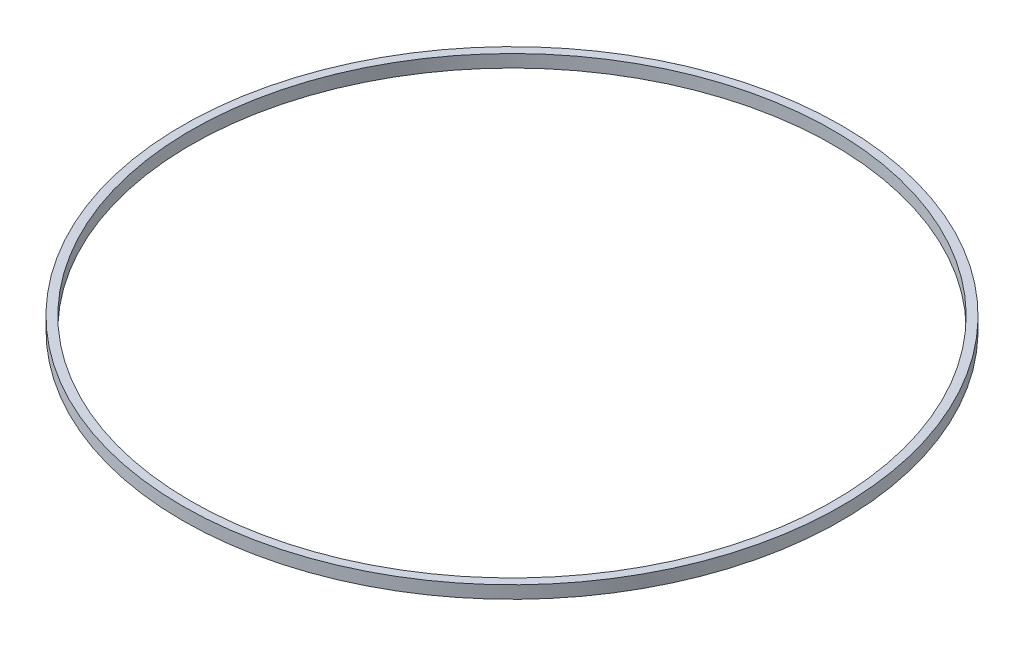
ISO-10303-21;
HEADER;
FILE_DESCRIPTION(('STEP AP214'),'2;1');
FILE_NAME('part.step','',(''),(''),'','','');
FILE_SCHEMA(('AUTOMOTIVE_DESIGN { 1 0 10303 214 1 1 1 1 }'));
ENDSEC;
DATA;
#1=APPLICATION_CONTEXT('core data for automotive mechanical design processes');
#2=APPLICATION_PROTOCOL_DEFINITION('international standard','automotive_design',2000,#1);
#3=PRODUCT_CONTEXT('',#1,'mechanical');
#4=PRODUCT('Part','Part','',(#3));
#5=PRODUCT_RELATED_PRODUCT_CATEGORY('part','',(#4));
#6=PRODUCT_DEFINITION_FORMATION('','',#4);
#7=PRODUCT_DEFINITION_CONTEXT('part definition',#1,'design');
#8=PRODUCT_DEFINITION('design','',#6,#7);
#9=PRODUCT_DEFINITION_SHAPE('','',#8);
#10=(LENGTH_UNIT() NAMED_UNIT(*) SI_UNIT(.MILLI.,.METRE.));
#11=(NAMED_UNIT(*) PLANE_ANGLE_UNIT() SI_UNIT($,.RADIAN.));
#12=(NAMED_UNIT(*) SI_UNIT($,.STERADIAN.) SOLID_ANGLE_UNIT());
#13=UNCERTAINTY_MEASURE_WITH_UNIT(LENGTH_MEASURE(1.E-05),#10,'distance_accuracy_value','');
#14=(GEOMETRIC_REPRESENTATION_CONTEXT(3) GLOBAL_UNCERTAINTY_ASSIGNED_CONTEXT((#13)) GLOBAL_UNIT_ASSIGNED_CONTEXT((#10,
#11,#12)) REPRESENTATION_CONTEXT('',''));
#15=CARTESIAN_POINT('',(0.,0.,0.));
#16=DIRECTION('',(0.,0.,1.));
#17=DIRECTION('',(1.,0.,0.));
#18=AXIS2_PLACEMENT_3D('',#15,#16,#17);
#19=CARTESIAN_POINT('',(0.,3.,0.));
#20=DIRECTION('',(0.,-1.,0.));
#21=DIRECTION('',(0.,0.,-1.));
#22=AXIS2_PLACEMENT_3D('',#19,#20,#21);
#23=CYLINDRICAL_SURFACE('',#22,78.5);
#24=CARTESIAN_POINT('',(0.,3.,0.));
#25=DIRECTION('',(0.,1.,0.));
#26=DIRECTION('',(0.,0.,1.));
#27=AXIS2_PLACEMENT_3D('',#24,#25,#26);
#28=CIRCLE('',#27,78.5);
#29=CARTESIAN_POINT('',(0.,3.,78.5));
#30=VERTEX_POINT('',#29);
#31=EDGE_CURVE('E10',#30,#30,#28,.T.);
#32=ORIENTED_EDGE('',*,*,#31,.F.);
#33=EDGE_LOOP('',(#32));
#34=FACE_BOUND('',#33,.T.);
#35=CARTESIAN_POINT('',(0.,0.,0.));
#36=DIRECTION('',(0.,1.,0.));
#37=DIRECTION('',(0.,0.,1.));
#38=AXIS2_PLACEMENT_3D('',#35,#36,#37);
#39=CIRCLE('',#38,78.5);
#40=CARTESIAN_POINT('',(0.,0.,78.5));
#41=VERTEX_POINT('',#40);
#42=EDGE_CURVE('E35',#41,#41,#39,.T.);
#43=ORIENTED_EDGE('',*,*,#42,.T.);
#44=EDGE_LOOP('',(#43));
#45=FACE_BOUND('',#44,.T.);
#46=ADVANCED_FACE('F32',(#34,#45),#23,.T.);
#47=CARTESIAN_POINT('',(0.,3.,0.));
#48=DIRECTION('',(0.,1.,0.));
#49=DIRECTION('',(0.,0.,1.));
#50=AXIS2_PLACEMENT_3D('',#47,#48,#49);
#51=PLANE('',#50);
#52=CARTESIAN_POINT('',(0.,3.,0.));
#53=DIRECTION('',(0.,1.,0.));
#54=DIRECTION('',(0.,0.,1.));
#55=AXIS2_PLACEMENT_3D('',#52,#53,#54);
#56=CIRCLE('',#55,76.5);
#57=CARTESIAN_POINT('',(0.,3.,76.5));
#58=VERTEX_POINT('',#57);
#59=EDGE_CURVE('E42',#58,#58,#56,.T.);
#60=ORIENTED_EDGE('',*,*,#59,.F.);
#61=EDGE_LOOP('',(#60));
#62=FACE_BOUND('',#61,.T.);
#63=ORIENTED_EDGE('',*,*,#31,.T.);
#64=EDGE_LOOP('',(#63));
#65=FACE_BOUND('',#64,.T.);
#66=ADVANCED_FACE('F60',(#62,#65),#51,.T.);
#67=CARTESIAN_POINT('',(0.,0.,0.));
#68=DIRECTION('',(0.,1.,0.));
#69=DIRECTION('',(0.,0.,1.));
#70=AXIS2_PLACEMENT_3D('',#67,#68,#69);
#71=PLANE('',#70);
#72=CARTESIAN_POINT('',(0.,0.,0.));
#73=DIRECTION('',(0.,1.,0.));
#74=DIRECTION('',(0.,0.,1.));
#75=AXIS2_PLACEMENT_3D('',#72,#73,#74);
#76=CIRCLE('',#75,76.5);
#77=CARTESIAN_POINT('',(0.,0.,76.5));
#78=VERTEX_POINT('',#77);
#79=EDGE_CURVE('E46',#78,#78,#76,.T.);
#80=ORIENTED_EDGE('',*,*,#79,.T.);
#81=EDGE_LOOP('',(#80));
#82=FACE_BOUND('',#81,.T.);
#83=ORIENTED_EDGE('',*,*,#42,.F.);
#84=EDGE_LOOP('',(#83));
#85=FACE_BOUND('',#84,.T.);
#86=ADVANCED_FACE('F50',(#82,#85),#71,.F.);
#87=CARTESIAN_POINT('',(0.,0.,0.));
#88=DIRECTION('',(0.,1.,0.));
#89=DIRECTION('',(0.,0.,1.));
#90=AXIS2_PLACEMENT_3D('',#87,#88,#89);
#91=CYLINDRICAL_SURFACE('',#90,76.5);
#92=ORIENTED_EDGE('',*,*,#59,.T.);
#93=EDGE_LOOP('',(#92));
#94=FACE_BOUND('',#93,.T.);
#95=ORIENTED_EDGE('',*,*,#79,.F.);
#96=EDGE_LOOP('',(#95));
#97=FACE_BOUND('',#96,.T.);
#98=ADVANCED_FACE('F53',(#94,#97),#91,.F.);
#99=CLOSED_SHELL('',(#46,#66,#86,#98));
#100=MANIFOLD_SOLID_BREP('B2',#99);
#101=ADVANCED_BREP_SHAPE_REPRESENTATION('',(#18,#100),#14);
#102=SHAPE_DEFINITION_REPRESENTATION(#9,#101);
ENDSEC;
END-ISO-10303-21;
